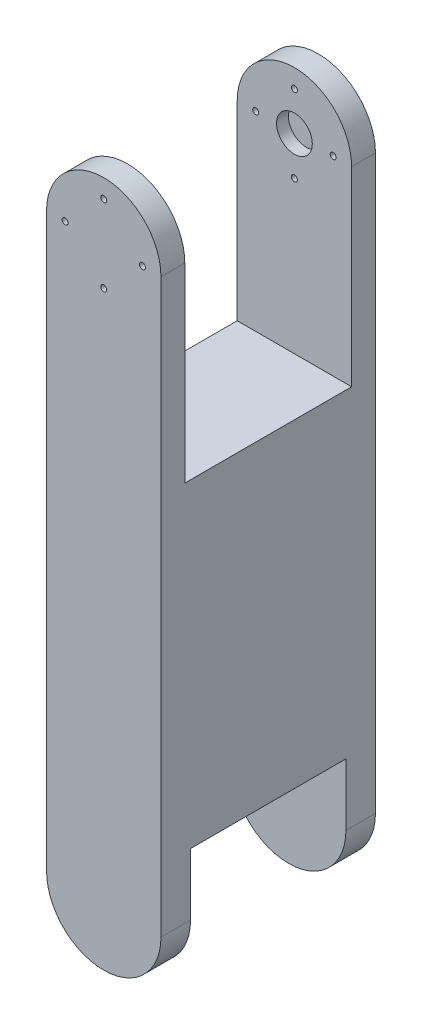
ISO-10303-21;
HEADER;
FILE_DESCRIPTION(('STEP AP214'),'2;1');
FILE_NAME('part.step','',(''),(''),'','','');
FILE_SCHEMA(('AUTOMOTIVE_DESIGN { 1 0 10303 214 1 1 1 1 }'));
ENDSEC;
DATA;
#1=APPLICATION_CONTEXT('core data for automotive mechanical design processes');
#2=APPLICATION_PROTOCOL_DEFINITION('international standard','automotive_design',2000,#1);
#3=PRODUCT_CONTEXT('',#1,'mechanical');
#4=PRODUCT('Part','Part','',(#3));
#5=PRODUCT_RELATED_PRODUCT_CATEGORY('part','',(#4));
#6=PRODUCT_DEFINITION_FORMATION('','',#4);
#7=PRODUCT_DEFINITION_CONTEXT('part definition',#1,'design');
#8=PRODUCT_DEFINITION('design','',#6,#7);
#9=PRODUCT_DEFINITION_SHAPE('','',#8);
#10=(LENGTH_UNIT() NAMED_UNIT(*) SI_UNIT(.MILLI.,.METRE.));
#11=(NAMED_UNIT(*) PLANE_ANGLE_UNIT() SI_UNIT($,.RADIAN.));
#12=(NAMED_UNIT(*) SI_UNIT($,.STERADIAN.) SOLID_ANGLE_UNIT());
#13=UNCERTAINTY_MEASURE_WITH_UNIT(LENGTH_MEASURE(1.E-05),#10,'distance_accuracy_value','');
#14=(GEOMETRIC_REPRESENTATION_CONTEXT(3) GLOBAL_UNCERTAINTY_ASSIGNED_CONTEXT((#13)) GLOBAL_UNIT_ASSIGNED_CONTEXT((#10,
#11,#12)) REPRESENTATION_CONTEXT('',''));
#15=CARTESIAN_POINT('',(0.,0.,0.));
#16=DIRECTION('',(0.,0.,1.));
#17=DIRECTION('',(1.,0.,0.));
#18=AXIS2_PLACEMENT_3D('',#15,#16,#17);
#19=CARTESIAN_POINT('',(0.,-76.2,57.15));
#20=DIRECTION('',(0.,0.,-1.));
#21=DIRECTION('',(-1.,0.,0.));
#22=AXIS2_PLACEMENT_3D('',#19,#20,#21);
#23=CYLINDRICAL_SURFACE('',#22,15.2399999999999);
#24=DIRECTION('',(0.,0.,-1.));
#25=VECTOR('',#24,1.);
#26=CARTESIAN_POINT('',(15.24,-76.2,57.15));
#27=LINE('',#26,#25);
#28=CARTESIAN_POINT('',(15.24,-76.2,7.874));
#29=VERTEX_POINT('',#28);
#30=CARTESIAN_POINT('',(15.24,-76.2,0.));
#31=VERTEX_POINT('',#30);
#32=EDGE_CURVE('E245',#29,#31,#27,.T.);
#33=ORIENTED_EDGE('',*,*,#32,.F.);
#34=CARTESIAN_POINT('',(0.,-76.2,7.874));
#35=DIRECTION('',(0.,0.,-1.));
#36=DIRECTION('',(-1.,0.,0.));
#37=AXIS2_PLACEMENT_3D('',#34,#35,#36);
#38=CIRCLE('',#37,15.2399999999999);
#39=CARTESIAN_POINT('',(-15.24,-76.2,7.874));
#40=VERTEX_POINT('',#39);
#41=EDGE_CURVE('E48',#29,#40,#38,.T.);
#42=ORIENTED_EDGE('',*,*,#41,.T.);
#43=DIRECTION('',(0.,0.,-1.));
#44=VECTOR('',#43,1.);
#45=CARTESIAN_POINT('',(-15.24,-76.2,57.15));
#46=LINE('',#45,#44);
#47=CARTESIAN_POINT('',(-15.24,-76.2,0.));
#48=VERTEX_POINT('',#47);
#49=EDGE_CURVE('E140',#40,#48,#46,.T.);
#50=ORIENTED_EDGE('',*,*,#49,.T.);
#51=CARTESIAN_POINT('',(0.,-76.2,0.));
#52=DIRECTION('',(0.,0.,1.));
#53=DIRECTION('',(1.,0.,0.));
#54=AXIS2_PLACEMENT_3D('',#51,#52,#53);
#55=CIRCLE('',#54,15.2399999999999);
#56=EDGE_CURVE('E237',#48,#31,#55,.T.);
#57=ORIENTED_EDGE('',*,*,#56,.T.);
#58=EDGE_LOOP('',(#33,#42,#50,#57));
#59=FACE_BOUND('',#58,.T.);
#60=ADVANCED_FACE('F33',(#59),#23,.T.);
#61=CARTESIAN_POINT('',(0.,76.2,57.15));
#62=DIRECTION('',(0.,0.,-1.));
#63=DIRECTION('',(-1.,0.,0.));
#64=AXIS2_PLACEMENT_3D('',#61,#62,#63);
#65=CYLINDRICAL_SURFACE('',#64,15.2399999999999);
#66=DIRECTION('',(0.,0.,-1.));
#67=VECTOR('',#66,1.);
#68=CARTESIAN_POINT('',(15.2399999999999,76.2,57.15));
#69=LINE('',#68,#67);
#70=CARTESIAN_POINT('',(15.2399999999999,76.2,57.15));
#71=VERTEX_POINT('',#70);
#72=CARTESIAN_POINT('',(15.2399999999999,76.2,50.8));
#73=VERTEX_POINT('',#72);
#74=EDGE_CURVE('E242',#71,#73,#69,.T.);
#75=ORIENTED_EDGE('',*,*,#74,.T.);
#76=CARTESIAN_POINT('',(0.,76.2,50.8));
#77=DIRECTION('',(0.,0.,1.));
#78=DIRECTION('',(0.,-1.,0.));
#79=AXIS2_PLACEMENT_3D('',#76,#77,#78);
#80=CIRCLE('',#79,15.2399999999999);
#81=CARTESIAN_POINT('',(-15.24,76.2,50.8));
#82=VERTEX_POINT('',#81);
#83=EDGE_CURVE('E219',#73,#82,#80,.T.);
#84=ORIENTED_EDGE('',*,*,#83,.T.);
#85=DIRECTION('',(0.,0.,-1.));
#86=VECTOR('',#85,1.);
#87=CARTESIAN_POINT('',(-15.24,76.2,57.15));
#88=LINE('',#87,#86);
#89=CARTESIAN_POINT('',(-15.24,76.2,57.15));
#90=VERTEX_POINT('',#89);
#91=EDGE_CURVE('E253',#90,#82,#88,.T.);
#92=ORIENTED_EDGE('',*,*,#91,.F.);
#93=CARTESIAN_POINT('',(0.,76.2,57.15));
#94=DIRECTION('',(0.,0.,1.));
#95=DIRECTION('',(-1.,0.,0.));
#96=AXIS2_PLACEMENT_3D('',#93,#94,#95);
#97=CIRCLE('',#96,15.2399999999999);
#98=EDGE_CURVE('E222',#71,#90,#97,.T.);
#99=ORIENTED_EDGE('',*,*,#98,.F.);
#100=EDGE_LOOP('',(#75,#84,#92,#99));
#101=FACE_BOUND('',#100,.T.);
#102=ADVANCED_FACE('F293',(#101),#65,.T.);
#103=CARTESIAN_POINT('',(0.,76.2,6.35));
#104=DIRECTION('',(0.,0.,-1.));
#105=DIRECTION('',(0.,1.,0.));
#106=AXIS2_PLACEMENT_3D('',#103,#104,#105);
#107=CIRCLE('',#106,15.2399999999999);
#108=CARTESIAN_POINT('',(-15.24,76.2,6.35));
#109=VERTEX_POINT('',#108);
#110=CARTESIAN_POINT('',(15.2399999999999,76.2,6.35));
#111=VERTEX_POINT('',#110);
#112=EDGE_CURVE('E214',#109,#111,#107,.T.);
#113=ORIENTED_EDGE('',*,*,#112,.T.);
#114=CARTESIAN_POINT('',(15.2399999999999,76.2,0.));
#115=VERTEX_POINT('',#114);
#116=EDGE_CURVE('E232',#111,#115,#69,.T.);
#117=ORIENTED_EDGE('',*,*,#116,.T.);
#118=CARTESIAN_POINT('',(0.,76.2,0.));
#119=DIRECTION('',(0.,0.,1.));
#120=DIRECTION('',(-1.,0.,0.));
#121=AXIS2_PLACEMENT_3D('',#118,#119,#120);
#122=CIRCLE('',#121,15.2399999999999);
#123=CARTESIAN_POINT('',(-15.24,76.2,0.));
#124=VERTEX_POINT('',#123);
#125=EDGE_CURVE('E221',#115,#124,#122,.T.);
#126=ORIENTED_EDGE('',*,*,#125,.T.);
#127=EDGE_CURVE('E252',#109,#124,#88,.T.);
#128=ORIENTED_EDGE('',*,*,#127,.F.);
#129=EDGE_LOOP('',(#113,#117,#126,#128));
#130=FACE_BOUND('',#129,.T.);
#131=ADVANCED_FACE('F35',(#130),#65,.T.);
#132=CARTESIAN_POINT('',(-15.24,76.2,57.15));
#133=DIRECTION('',(1.,0.,0.));
#134=DIRECTION('',(0.,0.,-1.));
#135=AXIS2_PLACEMENT_3D('',#132,#133,#134);
#136=PLANE('',#135);
#137=DIRECTION('',(0.,0.,1.));
#138=VECTOR('',#137,1.);
#139=CARTESIAN_POINT('',(-15.24,-59.6899999999999,49.276));
#140=LINE('',#139,#138);
#141=CARTESIAN_POINT('',(-15.24,-59.6899999999999,7.874));
#142=VERTEX_POINT('',#141);
#143=CARTESIAN_POINT('',(-15.24,-59.6899999999999,49.276));
#144=VERTEX_POINT('',#143);
#145=EDGE_CURVE('E130',#142,#144,#140,.T.);
#146=ORIENTED_EDGE('',*,*,#145,.T.);
#147=DIRECTION('',(0.,-1.,0.));
#148=VECTOR('',#147,1.);
#149=CARTESIAN_POINT('',(-15.24,-91.4399999999999,49.276));
#150=LINE('',#149,#148);
#151=CARTESIAN_POINT('',(-15.24,-76.2,49.276));
#152=VERTEX_POINT('',#151);
#153=EDGE_CURVE('E141',#144,#152,#150,.T.);
#154=ORIENTED_EDGE('',*,*,#153,.T.);
#155=CARTESIAN_POINT('',(-15.24,-76.2,57.15));
#156=VERTEX_POINT('',#155);
#157=EDGE_CURVE('E249',#156,#152,#46,.T.);
#158=ORIENTED_EDGE('',*,*,#157,.F.);
#159=DIRECTION('',(0.,-1.,0.));
#160=VECTOR('',#159,1.);
#161=CARTESIAN_POINT('',(-15.24,76.2,57.15));
#162=LINE('',#161,#160);
#163=EDGE_CURVE('E225',#90,#156,#162,.T.);
#164=ORIENTED_EDGE('',*,*,#163,.F.);
#165=ORIENTED_EDGE('',*,*,#91,.T.);
#166=DIRECTION('',(0.,-1.,0.));
#167=VECTOR('',#166,1.);
#168=CARTESIAN_POINT('',(-15.24,76.2,50.8));
#169=LINE('',#168,#167);
#170=CARTESIAN_POINT('',(-15.24,25.3999999999999,50.8));
#171=VERTEX_POINT('',#170);
#172=EDGE_CURVE('E216',#82,#171,#169,.T.);
#173=ORIENTED_EDGE('',*,*,#172,.T.);
#174=DIRECTION('',(0.,0.,-1.));
#175=VECTOR('',#174,1.);
#176=CARTESIAN_POINT('',(-15.24,25.3999999999999,57.15));
#177=LINE('',#176,#175);
#178=CARTESIAN_POINT('',(-15.24,25.3999999999999,6.34999999999999));
#179=VERTEX_POINT('',#178);
#180=EDGE_CURVE('E207',#171,#179,#177,.T.);
#181=ORIENTED_EDGE('',*,*,#180,.T.);
#182=DIRECTION('',(0.,1.,0.));
#183=VECTOR('',#182,1.);
#184=CARTESIAN_POINT('',(-15.24,76.2,6.35));
#185=LINE('',#184,#183);
#186=EDGE_CURVE('E211',#179,#109,#185,.T.);
#187=ORIENTED_EDGE('',*,*,#186,.T.);
#188=ORIENTED_EDGE('',*,*,#127,.T.);
#189=DIRECTION('',(0.,-1.,0.));
#190=VECTOR('',#189,1.);
#191=CARTESIAN_POINT('',(-15.24,76.2,0.));
#192=LINE('',#191,#190);
#193=EDGE_CURVE('E235',#124,#48,#192,.T.);
#194=ORIENTED_EDGE('',*,*,#193,.T.);
#195=ORIENTED_EDGE('',*,*,#49,.F.);
#196=DIRECTION('',(0.,1.,0.));
#197=VECTOR('',#196,1.);
#198=CARTESIAN_POINT('',(-15.24,-91.4399999999999,7.874));
#199=LINE('',#198,#197);
#200=EDGE_CURVE('E124',#40,#142,#199,.T.);
#201=ORIENTED_EDGE('',*,*,#200,.T.);
#202=EDGE_LOOP('',(#146,#154,#158,#164,#165,#173,#181,#187,#188,#194,#195,#201));
#203=FACE_BOUND('',#202,.T.);
#204=ADVANCED_FACE('F138',(#203),#136,.F.);
#205=ORIENTED_EDGE('',*,*,#157,.T.);
#206=CARTESIAN_POINT('',(0.,-76.2,49.276));
#207=DIRECTION('',(0.,0.,1.));
#208=DIRECTION('',(1.,0.,0.));
#209=AXIS2_PLACEMENT_3D('',#206,#207,#208);
#210=CIRCLE('',#209,15.2399999999999);
#211=CARTESIAN_POINT('',(15.2399999999999,-76.2,49.276));
#212=VERTEX_POINT('',#211);
#213=EDGE_CURVE('E152',#152,#212,#210,.T.);
#214=ORIENTED_EDGE('',*,*,#213,.T.);
#215=CARTESIAN_POINT('',(15.24,-76.2,57.15));
#216=VERTEX_POINT('',#215);
#217=EDGE_CURVE('E246',#216,#212,#27,.T.);
#218=ORIENTED_EDGE('',*,*,#217,.F.);
#219=CARTESIAN_POINT('',(0.,-76.2,57.15));
#220=DIRECTION('',(0.,0.,1.));
#221=DIRECTION('',(1.,0.,0.));
#222=AXIS2_PLACEMENT_3D('',#219,#220,#221);
#223=CIRCLE('',#222,15.2399999999999);
#224=EDGE_CURVE('E228',#156,#216,#223,.T.);
#225=ORIENTED_EDGE('',*,*,#224,.F.);
#226=EDGE_LOOP('',(#205,#214,#218,#225));
#227=FACE_BOUND('',#226,.T.);
#228=ADVANCED_FACE('F296',(#227),#23,.T.);
#229=CARTESIAN_POINT('',(15.2399999999999,76.2,57.15));
#230=DIRECTION('',(-1.,0.,0.));
#231=DIRECTION('',(0.,-1.,0.));
#232=AXIS2_PLACEMENT_3D('',#229,#230,#231);
#233=PLANE('',#232);
#234=ORIENTED_EDGE('',*,*,#217,.T.);
#235=DIRECTION('',(0.,-1.,0.));
#236=VECTOR('',#235,1.);
#237=CARTESIAN_POINT('',(15.2399999999999,-91.4399999999999,49.276));
#238=LINE('',#237,#236);
#239=CARTESIAN_POINT('',(15.2399999999999,-59.6899999999999,49.276));
#240=VERTEX_POINT('',#239);
#241=EDGE_CURVE('E146',#240,#212,#238,.T.);
#242=ORIENTED_EDGE('',*,*,#241,.F.);
#243=DIRECTION('',(0.,0.,1.));
#244=VECTOR('',#243,1.);
#245=CARTESIAN_POINT('',(15.2399999999999,-59.6899999999999,49.276));
#246=LINE('',#245,#244);
#247=CARTESIAN_POINT('',(15.2399999999999,-59.6899999999999,7.874));
#248=VERTEX_POINT('',#247);
#249=EDGE_CURVE('E143',#248,#240,#246,.T.);
#250=ORIENTED_EDGE('',*,*,#249,.F.);
#251=DIRECTION('',(0.,-1.,0.));
#252=VECTOR('',#251,1.);
#253=CARTESIAN_POINT('',(15.2399999999999,76.2,7.874));
#254=LINE('',#253,#252);
#255=EDGE_CURVE('E11',#248,#29,#254,.T.);
#256=ORIENTED_EDGE('',*,*,#255,.T.);
#257=ORIENTED_EDGE('',*,*,#32,.T.);
#258=DIRECTION('',(0.,1.,0.));
#259=VECTOR('',#258,1.);
#260=CARTESIAN_POINT('',(15.2399999999999,76.2,0.));
#261=LINE('',#260,#259);
#262=EDGE_CURVE('E226',#31,#115,#261,.T.);
#263=ORIENTED_EDGE('',*,*,#262,.T.);
#264=ORIENTED_EDGE('',*,*,#116,.F.);
#265=DIRECTION('',(0.,1.,0.));
#266=VECTOR('',#265,1.);
#267=CARTESIAN_POINT('',(15.2399999999999,91.4399999999999,6.35));
#268=LINE('',#267,#266);
#269=CARTESIAN_POINT('',(15.2399999999999,25.3999999999999,6.34999999999999));
#270=VERTEX_POINT('',#269);
#271=EDGE_CURVE('E202',#270,#111,#268,.T.);
#272=ORIENTED_EDGE('',*,*,#271,.F.);
#273=DIRECTION('',(0.,0.,-1.));
#274=VECTOR('',#273,1.);
#275=CARTESIAN_POINT('',(15.2399999999999,25.3999999999999,50.8));
#276=LINE('',#275,#274);
#277=CARTESIAN_POINT('',(15.2399999999999,25.3999999999999,50.8));
#278=VERTEX_POINT('',#277);
#279=EDGE_CURVE('E198',#278,#270,#276,.T.);
#280=ORIENTED_EDGE('',*,*,#279,.F.);
#281=DIRECTION('',(0.,1.,0.));
#282=VECTOR('',#281,1.);
#283=CARTESIAN_POINT('',(15.2399999999999,76.2,50.8));
#284=LINE('',#283,#282);
#285=EDGE_CURVE('E41',#278,#73,#284,.T.);
#286=ORIENTED_EDGE('',*,*,#285,.T.);
#287=ORIENTED_EDGE('',*,*,#74,.F.);
#288=DIRECTION('',(0.,1.,0.));
#289=VECTOR('',#288,1.);
#290=CARTESIAN_POINT('',(15.2399999999999,76.2,57.15));
#291=LINE('',#290,#289);
#292=EDGE_CURVE('E230',#216,#71,#291,.T.);
#293=ORIENTED_EDGE('',*,*,#292,.F.);
#294=EDGE_LOOP('',(#234,#242,#250,#256,#257,#263,#264,#272,#280,#286,#287,#293));
#295=FACE_BOUND('',#294,.T.);
#296=ADVANCED_FACE('F304',(#295),#233,.F.);
#297=CARTESIAN_POINT('',(0.,76.2,57.15));
#298=DIRECTION('',(0.,0.,-1.));
#299=DIRECTION('',(-1.,0.,0.));
#300=AXIS2_PLACEMENT_3D('',#297,#298,#299);
#301=PLANE('',#300);
#302=CARTESIAN_POINT('',(0.,65.88125,57.15));
#303=DIRECTION('',(0.,0.,-1.));
#304=DIRECTION('',(-1.,0.,0.));
#305=AXIS2_PLACEMENT_3D('',#302,#303,#304);
#306=CIRCLE('',#305,0.793749999999999);
#307=CARTESIAN_POINT('',(-0.793749999999999,65.88125,57.15));
#308=VERTEX_POINT('',#307);
#309=EDGE_CURVE('E155',#308,#308,#306,.T.);
#310=ORIENTED_EDGE('',*,*,#309,.T.);
#311=EDGE_LOOP('',(#310));
#312=FACE_BOUND('',#311,.T.);
#313=CARTESIAN_POINT('',(10.31875,76.2,57.15));
#314=DIRECTION('',(0.,0.,-1.));
#315=DIRECTION('',(-1.,0.,0.));
#316=AXIS2_PLACEMENT_3D('',#313,#314,#315);
#317=CIRCLE('',#316,0.793749999999993);
#318=CARTESIAN_POINT('',(9.52500000000001,76.2,57.15));
#319=VERTEX_POINT('',#318);
#320=EDGE_CURVE('E162',#319,#319,#317,.T.);
#321=ORIENTED_EDGE('',*,*,#320,.T.);
#322=EDGE_LOOP('',(#321));
#323=FACE_BOUND('',#322,.T.);
#324=CARTESIAN_POINT('',(0.,86.51875,57.15));
#325=DIRECTION('',(0.,0.,-1.));
#326=DIRECTION('',(-1.,0.,0.));
#327=AXIS2_PLACEMENT_3D('',#324,#325,#326);
#328=CIRCLE('',#327,0.79375);
#329=CARTESIAN_POINT('',(-0.793749999999998,86.51875,57.15));
#330=VERTEX_POINT('',#329);
#331=EDGE_CURVE('E168',#330,#330,#328,.T.);
#332=ORIENTED_EDGE('',*,*,#331,.T.);
#333=EDGE_LOOP('',(#332));
#334=FACE_BOUND('',#333,.T.);
#335=CARTESIAN_POINT('',(-10.31875,76.1999999999999,57.15));
#336=DIRECTION('',(0.,0.,-1.));
#337=DIRECTION('',(-1.,0.,0.));
#338=AXIS2_PLACEMENT_3D('',#335,#336,#337);
#339=CIRCLE('',#338,0.793750000000001);
#340=CARTESIAN_POINT('',(-11.1125,76.1999999999999,57.15));
#341=VERTEX_POINT('',#340);
#342=EDGE_CURVE('E174',#341,#341,#339,.T.);
#343=ORIENTED_EDGE('',*,*,#342,.T.);
#344=EDGE_LOOP('',(#343));
#345=FACE_BOUND('',#344,.T.);
#346=ORIENTED_EDGE('',*,*,#98,.T.);
#347=ORIENTED_EDGE('',*,*,#163,.T.);
#348=ORIENTED_EDGE('',*,*,#224,.T.);
#349=ORIENTED_EDGE('',*,*,#292,.T.);
#350=EDGE_LOOP('',(#346,#347,#348,#349));
#351=FACE_BOUND('',#350,.T.);
#352=ADVANCED_FACE('F310',(#312,#323,#334,#345,#351),#301,.F.);
#353=CARTESIAN_POINT('',(0.,76.2,0.));
#354=DIRECTION('',(0.,0.,-1.));
#355=DIRECTION('',(-1.,0.,0.));
#356=AXIS2_PLACEMENT_3D('',#353,#354,#355);
#357=PLANE('',#356);
#358=CARTESIAN_POINT('',(0.,65.88125,0.));
#359=DIRECTION('',(0.,0.,-1.));
#360=DIRECTION('',(-1.,0.,0.));
#361=AXIS2_PLACEMENT_3D('',#358,#359,#360);
#362=CIRCLE('',#361,0.793749999999999);
#363=CARTESIAN_POINT('',(-0.793749999999999,65.88125,0.));
#364=VERTEX_POINT('',#363);
#365=EDGE_CURVE('E159',#364,#364,#362,.T.);
#366=ORIENTED_EDGE('',*,*,#365,.F.);
#367=EDGE_LOOP('',(#366));
#368=FACE_BOUND('',#367,.T.);
#369=CARTESIAN_POINT('',(10.31875,76.2,0.));
#370=DIRECTION('',(0.,0.,-1.));
#371=DIRECTION('',(-1.,0.,0.));
#372=AXIS2_PLACEMENT_3D('',#369,#370,#371);
#373=CIRCLE('',#372,0.793749999999993);
#374=CARTESIAN_POINT('',(9.52500000000001,76.2,0.));
#375=VERTEX_POINT('',#374);
#376=EDGE_CURVE('E165',#375,#375,#373,.T.);
#377=ORIENTED_EDGE('',*,*,#376,.F.);
#378=EDGE_LOOP('',(#377));
#379=FACE_BOUND('',#378,.T.);
#380=CARTESIAN_POINT('',(0.,86.51875,0.));
#381=DIRECTION('',(0.,0.,-1.));
#382=DIRECTION('',(-1.,0.,0.));
#383=AXIS2_PLACEMENT_3D('',#380,#381,#382);
#384=CIRCLE('',#383,0.79375);
#385=CARTESIAN_POINT('',(-0.793749999999998,86.51875,0.));
#386=VERTEX_POINT('',#385);
#387=EDGE_CURVE('E171',#386,#386,#384,.T.);
#388=ORIENTED_EDGE('',*,*,#387,.F.);
#389=EDGE_LOOP('',(#388));
#390=FACE_BOUND('',#389,.T.);
#391=CARTESIAN_POINT('',(-10.31875,76.1999999999999,0.));
#392=DIRECTION('',(0.,0.,-1.));
#393=DIRECTION('',(-1.,0.,0.));
#394=AXIS2_PLACEMENT_3D('',#391,#392,#393);
#395=CIRCLE('',#394,0.793750000000001);
#396=CARTESIAN_POINT('',(-11.1125,76.1999999999999,0.));
#397=VERTEX_POINT('',#396);
#398=EDGE_CURVE('E154',#397,#397,#395,.T.);
#399=ORIENTED_EDGE('',*,*,#398,.F.);
#400=EDGE_LOOP('',(#399));
#401=FACE_BOUND('',#400,.T.);
#402=ORIENTED_EDGE('',*,*,#125,.F.);
#403=ORIENTED_EDGE('',*,*,#262,.F.);
#404=ORIENTED_EDGE('',*,*,#56,.F.);
#405=ORIENTED_EDGE('',*,*,#193,.F.);
#406=EDGE_LOOP('',(#402,#403,#404,#405));
#407=FACE_BOUND('',#406,.T.);
#408=ADVANCED_FACE('F337',(#368,#379,#390,#401,#407),#357,.T.);
#409=CARTESIAN_POINT('',(-41.9100000000001,91.4399999999999,50.8));
#410=DIRECTION('',(0.,0.,1.));
#411=DIRECTION('',(0.,-1.,0.));
#412=AXIS2_PLACEMENT_3D('',#409,#410,#411);
#413=PLANE('',#412);
#414=CARTESIAN_POINT('',(0.,65.88125,50.8));
#415=DIRECTION('',(0.,0.,1.));
#416=DIRECTION('',(0.,-1.,0.));
#417=AXIS2_PLACEMENT_3D('',#414,#415,#416);
#418=CIRCLE('',#417,0.793749999999999);
#419=CARTESIAN_POINT('',(0.,65.0874999999999,50.8));
#420=VERTEX_POINT('',#419);
#421=EDGE_CURVE('E191',#420,#420,#418,.T.);
#422=ORIENTED_EDGE('',*,*,#421,.T.);
#423=EDGE_LOOP('',(#422));
#424=FACE_BOUND('',#423,.T.);
#425=CARTESIAN_POINT('',(10.31875,76.2,50.8));
#426=DIRECTION('',(0.,0.,1.));
#427=DIRECTION('',(0.,-1.,0.));
#428=AXIS2_PLACEMENT_3D('',#425,#426,#427);
#429=CIRCLE('',#428,0.793749999999993);
#430=CARTESIAN_POINT('',(10.31875,75.40625,50.8));
#431=VERTEX_POINT('',#430);
#432=EDGE_CURVE('E187',#431,#431,#429,.T.);
#433=ORIENTED_EDGE('',*,*,#432,.T.);
#434=EDGE_LOOP('',(#433));
#435=FACE_BOUND('',#434,.T.);
#436=CARTESIAN_POINT('',(0.,86.51875,50.8));
#437=DIRECTION('',(0.,0.,1.));
#438=DIRECTION('',(0.,-1.,0.));
#439=AXIS2_PLACEMENT_3D('',#436,#437,#438);
#440=CIRCLE('',#439,0.79375);
#441=CARTESIAN_POINT('',(0.,85.725,50.8));
#442=VERTEX_POINT('',#441);
#443=EDGE_CURVE('E183',#442,#442,#440,.T.);
#444=ORIENTED_EDGE('',*,*,#443,.T.);
#445=EDGE_LOOP('',(#444));
#446=FACE_BOUND('',#445,.T.);
#447=CARTESIAN_POINT('',(-10.31875,76.1999999999999,50.8));
#448=DIRECTION('',(0.,0.,1.));
#449=DIRECTION('',(0.,-1.,0.));
#450=AXIS2_PLACEMENT_3D('',#447,#448,#449);
#451=CIRCLE('',#450,0.793750000000001);
#452=CARTESIAN_POINT('',(-10.31875,75.40625,50.8));
#453=VERTEX_POINT('',#452);
#454=EDGE_CURVE('E179',#453,#453,#451,.T.);
#455=ORIENTED_EDGE('',*,*,#454,.T.);
#456=EDGE_LOOP('',(#455));
#457=FACE_BOUND('',#456,.T.);
#458=ORIENTED_EDGE('',*,*,#285,.F.);
#459=DIRECTION('',(1.,0.,0.));
#460=VECTOR('',#459,1.);
#461=CARTESIAN_POINT('',(-41.9100000000001,25.3999999999999,50.8));
#462=LINE('',#461,#460);
#463=EDGE_CURVE('E55',#171,#278,#462,.T.);
#464=ORIENTED_EDGE('',*,*,#463,.F.);
#465=ORIENTED_EDGE('',*,*,#172,.F.);
#466=ORIENTED_EDGE('',*,*,#83,.F.);
#467=EDGE_LOOP('',(#458,#464,#465,#466));
#468=FACE_BOUND('',#467,.T.);
#469=ADVANCED_FACE('F324',(#424,#435,#446,#457,#468),#413,.F.);
#470=CARTESIAN_POINT('',(-41.9100000000001,91.4399999999999,6.35));
#471=DIRECTION('',(0.,0.,-1.));
#472=DIRECTION('',(0.,1.,0.));
#473=AXIS2_PLACEMENT_3D('',#470,#471,#472);
#474=PLANE('',#473);
#475=CARTESIAN_POINT('',(0.,65.88125,6.35));
#476=DIRECTION('',(0.,0.,-1.));
#477=DIRECTION('',(0.,1.,0.));
#478=AXIS2_PLACEMENT_3D('',#475,#476,#477);
#479=CIRCLE('',#478,0.793749999999999);
#480=CARTESIAN_POINT('',(0.,66.6749999999999,6.35));
#481=VERTEX_POINT('',#480);
#482=EDGE_CURVE('E190',#481,#481,#479,.T.);
#483=ORIENTED_EDGE('',*,*,#482,.T.);
#484=EDGE_LOOP('',(#483));
#485=FACE_BOUND('',#484,.T.);
#486=CARTESIAN_POINT('',(10.31875,76.2,6.35));
#487=DIRECTION('',(0.,0.,-1.));
#488=DIRECTION('',(0.,1.,0.));
#489=AXIS2_PLACEMENT_3D('',#486,#487,#488);
#490=CIRCLE('',#489,0.793749999999993);
#491=CARTESIAN_POINT('',(10.31875,76.99375,6.35));
#492=VERTEX_POINT('',#491);
#493=EDGE_CURVE('E186',#492,#492,#490,.T.);
#494=ORIENTED_EDGE('',*,*,#493,.T.);
#495=EDGE_LOOP('',(#494));
#496=FACE_BOUND('',#495,.T.);
#497=CARTESIAN_POINT('',(0.,86.51875,6.35));
#498=DIRECTION('',(0.,0.,-1.));
#499=DIRECTION('',(0.,1.,0.));
#500=AXIS2_PLACEMENT_3D('',#497,#498,#499);
#501=CIRCLE('',#500,0.79375);
#502=CARTESIAN_POINT('',(0.,87.3125,6.35));
#503=VERTEX_POINT('',#502);
#504=EDGE_CURVE('E182',#503,#503,#501,.T.);
#505=ORIENTED_EDGE('',*,*,#504,.T.);
#506=EDGE_LOOP('',(#505));
#507=FACE_BOUND('',#506,.T.);
#508=CARTESIAN_POINT('',(-10.31875,76.1999999999999,6.35));
#509=DIRECTION('',(0.,0.,-1.));
#510=DIRECTION('',(0.,1.,0.));
#511=AXIS2_PLACEMENT_3D('',#508,#509,#510);
#512=CIRCLE('',#511,0.793750000000001);
#513=CARTESIAN_POINT('',(-10.31875,76.9937499999999,6.35));
#514=VERTEX_POINT('',#513);
#515=EDGE_CURVE('E158',#514,#514,#512,.T.);
#516=ORIENTED_EDGE('',*,*,#515,.T.);
#517=EDGE_LOOP('',(#516));
#518=FACE_BOUND('',#517,.T.);
#519=CARTESIAN_POINT('',(0.,76.1999999999999,6.34999999999999));
#520=DIRECTION('',(0.,0.,1.));
#521=DIRECTION('',(1.,0.,0.));
#522=AXIS2_PLACEMENT_3D('',#519,#520,#521);
#523=CIRCLE('',#522,4.7625);
#524=CARTESIAN_POINT('',(4.7625,76.1999999999999,6.34999999999999));
#525=VERTEX_POINT('',#524);
#526=EDGE_CURVE('E194',#525,#525,#523,.T.);
#527=ORIENTED_EDGE('',*,*,#526,.F.);
#528=EDGE_LOOP('',(#527));
#529=FACE_BOUND('',#528,.T.);
#530=ORIENTED_EDGE('',*,*,#112,.F.);
#531=ORIENTED_EDGE('',*,*,#186,.F.);
#532=DIRECTION('',(1.,0.,0.));
#533=VECTOR('',#532,1.);
#534=CARTESIAN_POINT('',(-41.9100000000001,25.3999999999999,6.34999999999999));
#535=LINE('',#534,#533);
#536=EDGE_CURVE('E205',#179,#270,#535,.T.);
#537=ORIENTED_EDGE('',*,*,#536,.T.);
#538=ORIENTED_EDGE('',*,*,#271,.T.);
#539=EDGE_LOOP('',(#530,#531,#537,#538));
#540=FACE_BOUND('',#539,.T.);
#541=ADVANCED_FACE('F266',(#485,#496,#507,#518,#529,#540),#474,.F.);
#542=CARTESIAN_POINT('',(-41.9100000000001,25.3999999999999,50.8));
#543=DIRECTION('',(0.,-1.,0.));
#544=DIRECTION('',(1.,0.,0.));
#545=AXIS2_PLACEMENT_3D('',#542,#543,#544);
#546=PLANE('',#545);
#547=ORIENTED_EDGE('',*,*,#463,.T.);
#548=ORIENTED_EDGE('',*,*,#279,.T.);
#549=ORIENTED_EDGE('',*,*,#536,.F.);
#550=ORIENTED_EDGE('',*,*,#180,.F.);
#551=EDGE_LOOP('',(#547,#548,#549,#550));
#552=FACE_BOUND('',#551,.T.);
#553=ADVANCED_FACE('F329',(#552),#546,.F.);
#554=CARTESIAN_POINT('',(0.,76.1999999999999,3.17499999999999));
#555=DIRECTION('',(0.,0.,1.));
#556=DIRECTION('',(1.,0.,0.));
#557=AXIS2_PLACEMENT_3D('',#554,#555,#556);
#558=CYLINDRICAL_SURFACE('',#557,4.7625);
#559=CARTESIAN_POINT('',(0.,76.1999999999999,3.17499999999999));
#560=DIRECTION('',(0.,0.,1.));
#561=DIRECTION('',(1.,0.,0.));
#562=AXIS2_PLACEMENT_3D('',#559,#560,#561);
#563=CIRCLE('',#562,4.7625);
#564=CARTESIAN_POINT('',(4.7625,76.1999999999999,3.17499999999999));
#565=VERTEX_POINT('',#564);
#566=EDGE_CURVE('E195',#565,#565,#563,.T.);
#567=ORIENTED_EDGE('',*,*,#566,.F.);
#568=EDGE_LOOP('',(#567));
#569=FACE_BOUND('',#568,.T.);
#570=ORIENTED_EDGE('',*,*,#526,.T.);
#571=EDGE_LOOP('',(#570));
#572=FACE_BOUND('',#571,.T.);
#573=ADVANCED_FACE('F355',(#569,#572),#558,.F.);
#574=CARTESIAN_POINT('',(0.,76.1999999999999,3.17499999999999));
#575=DIRECTION('',(0.,0.,1.));
#576=DIRECTION('',(1.,0.,0.));
#577=AXIS2_PLACEMENT_3D('',#574,#575,#576);
#578=PLANE('',#577);
#579=ORIENTED_EDGE('',*,*,#566,.T.);
#580=EDGE_LOOP('',(#579));
#581=FACE_BOUND('',#580,.T.);
#582=ADVANCED_FACE('F360',(#581),#578,.T.);
#583=CARTESIAN_POINT('',(-10.31875,76.1999999999999,57.15));
#584=DIRECTION('',(0.,0.,-1.));
#585=DIRECTION('',(-1.,0.,0.));
#586=AXIS2_PLACEMENT_3D('',#583,#584,#585);
#587=CYLINDRICAL_SURFACE('',#586,0.793750000000001);
#588=ORIENTED_EDGE('',*,*,#398,.T.);
#589=EDGE_LOOP('',(#588));
#590=FACE_BOUND('',#589,.T.);
#591=ORIENTED_EDGE('',*,*,#515,.F.);
#592=EDGE_LOOP('',(#591));
#593=FACE_BOUND('',#592,.T.);
#594=ADVANCED_FACE('F283',(#590,#593),#587,.F.);
#595=CARTESIAN_POINT('',(0.,86.51875,57.15));
#596=DIRECTION('',(0.,0.,-1.));
#597=DIRECTION('',(-1.,0.,0.));
#598=AXIS2_PLACEMENT_3D('',#595,#596,#597);
#599=CYLINDRICAL_SURFACE('',#598,0.79375);
#600=ORIENTED_EDGE('',*,*,#387,.T.);
#601=EDGE_LOOP('',(#600));
#602=FACE_BOUND('',#601,.T.);
#603=ORIENTED_EDGE('',*,*,#504,.F.);
#604=EDGE_LOOP('',(#603));
#605=FACE_BOUND('',#604,.T.);
#606=ADVANCED_FACE('F284',(#602,#605),#599,.F.);
#607=CARTESIAN_POINT('',(10.31875,76.2,57.15));
#608=DIRECTION('',(0.,0.,-1.));
#609=DIRECTION('',(-1.,0.,0.));
#610=AXIS2_PLACEMENT_3D('',#607,#608,#609);
#611=CYLINDRICAL_SURFACE('',#610,0.793749999999993);
#612=ORIENTED_EDGE('',*,*,#376,.T.);
#613=EDGE_LOOP('',(#612));
#614=FACE_BOUND('',#613,.T.);
#615=ORIENTED_EDGE('',*,*,#493,.F.);
#616=EDGE_LOOP('',(#615));
#617=FACE_BOUND('',#616,.T.);
#618=ADVANCED_FACE('F272',(#614,#617),#611,.F.);
#619=CARTESIAN_POINT('',(0.,65.88125,57.15));
#620=DIRECTION('',(0.,0.,-1.));
#621=DIRECTION('',(-1.,0.,0.));
#622=AXIS2_PLACEMENT_3D('',#619,#620,#621);
#623=CYLINDRICAL_SURFACE('',#622,0.793749999999999);
#624=ORIENTED_EDGE('',*,*,#365,.T.);
#625=EDGE_LOOP('',(#624));
#626=FACE_BOUND('',#625,.T.);
#627=ORIENTED_EDGE('',*,*,#482,.F.);
#628=EDGE_LOOP('',(#627));
#629=FACE_BOUND('',#628,.T.);
#630=ADVANCED_FACE('F269',(#626,#629),#623,.F.);
#631=ORIENTED_EDGE('',*,*,#342,.F.);
#632=EDGE_LOOP('',(#631));
#633=FACE_BOUND('',#632,.T.);
#634=ORIENTED_EDGE('',*,*,#454,.F.);
#635=EDGE_LOOP('',(#634));
#636=FACE_BOUND('',#635,.T.);
#637=ADVANCED_FACE('F271',(#633,#636),#587,.F.);
#638=ORIENTED_EDGE('',*,*,#331,.F.);
#639=EDGE_LOOP('',(#638));
#640=FACE_BOUND('',#639,.T.);
#641=ORIENTED_EDGE('',*,*,#443,.F.);
#642=EDGE_LOOP('',(#641));
#643=FACE_BOUND('',#642,.T.);
#644=ADVANCED_FACE('F280',(#640,#643),#599,.F.);
#645=ORIENTED_EDGE('',*,*,#320,.F.);
#646=EDGE_LOOP('',(#645));
#647=FACE_BOUND('',#646,.T.);
#648=ORIENTED_EDGE('',*,*,#432,.F.);
#649=EDGE_LOOP('',(#648));
#650=FACE_BOUND('',#649,.T.);
#651=ADVANCED_FACE('F287',(#647,#650),#611,.F.);
#652=ORIENTED_EDGE('',*,*,#309,.F.);
#653=EDGE_LOOP('',(#652));
#654=FACE_BOUND('',#653,.T.);
#655=ORIENTED_EDGE('',*,*,#421,.F.);
#656=EDGE_LOOP('',(#655));
#657=FACE_BOUND('',#656,.T.);
#658=ADVANCED_FACE('F275',(#654,#657),#623,.F.);
#659=CARTESIAN_POINT('',(-15.24,-91.4399999999999,49.276));
#660=DIRECTION('',(0.,0.,1.));
#661=DIRECTION('',(1.,0.,0.));
#662=AXIS2_PLACEMENT_3D('',#659,#660,#661);
#663=PLANE('',#662);
#664=ORIENTED_EDGE('',*,*,#153,.F.);
#665=DIRECTION('',(1.,0.,0.));
#666=VECTOR('',#665,1.);
#667=CARTESIAN_POINT('',(-15.24,-59.6899999999999,49.276));
#668=LINE('',#667,#666);
#669=EDGE_CURVE('E129',#144,#240,#668,.T.);
#670=ORIENTED_EDGE('',*,*,#669,.T.);
#671=ORIENTED_EDGE('',*,*,#241,.T.);
#672=ORIENTED_EDGE('',*,*,#213,.F.);
#673=EDGE_LOOP('',(#664,#670,#671,#672));
#674=FACE_BOUND('',#673,.T.);
#675=ADVANCED_FACE('F290',(#674),#663,.F.);
#676=CARTESIAN_POINT('',(-15.24,-91.4399999999999,7.874));
#677=DIRECTION('',(0.,0.,-1.));
#678=DIRECTION('',(-1.,0.,0.));
#679=AXIS2_PLACEMENT_3D('',#676,#677,#678);
#680=PLANE('',#679);
#681=ORIENTED_EDGE('',*,*,#255,.F.);
#682=DIRECTION('',(1.,0.,0.));
#683=VECTOR('',#682,1.);
#684=CARTESIAN_POINT('',(-15.24,-59.6899999999999,7.874));
#685=LINE('',#684,#683);
#686=EDGE_CURVE('E120',#142,#248,#685,.T.);
#687=ORIENTED_EDGE('',*,*,#686,.F.);
#688=ORIENTED_EDGE('',*,*,#200,.F.);
#689=ORIENTED_EDGE('',*,*,#41,.F.);
#690=EDGE_LOOP('',(#681,#687,#688,#689));
#691=FACE_BOUND('',#690,.T.);
#692=ADVANCED_FACE('F122',(#691),#680,.F.);
#693=CARTESIAN_POINT('',(-15.24,-59.6899999999999,49.276));
#694=DIRECTION('',(0.,1.,0.));
#695=DIRECTION('',(-1.,0.,0.));
#696=AXIS2_PLACEMENT_3D('',#693,#694,#695);
#697=PLANE('',#696);
#698=ORIENTED_EDGE('',*,*,#249,.T.);
#699=ORIENTED_EDGE('',*,*,#669,.F.);
#700=ORIENTED_EDGE('',*,*,#145,.F.);
#701=ORIENTED_EDGE('',*,*,#686,.T.);
#702=EDGE_LOOP('',(#698,#699,#700,#701));
#703=FACE_BOUND('',#702,.T.);
#704=ADVANCED_FACE('F133',(#703),#697,.F.);
#705=CLOSED_SHELL('',(#60,#102,#131,#204,#228,#296,#352,#408,#469,#541,#553,#573,#582,#594,#606,
#618,#630,#637,#644,#651,#658,#675,#692,#704));
#706=MANIFOLD_SOLID_BREP('B2',#705);
#707=ADVANCED_BREP_SHAPE_REPRESENTATION('',(#18,#706),#14);
#708=SHAPE_DEFINITION_REPRESENTATION(#9,#707);
ENDSEC;
END-ISO-10303-21;
